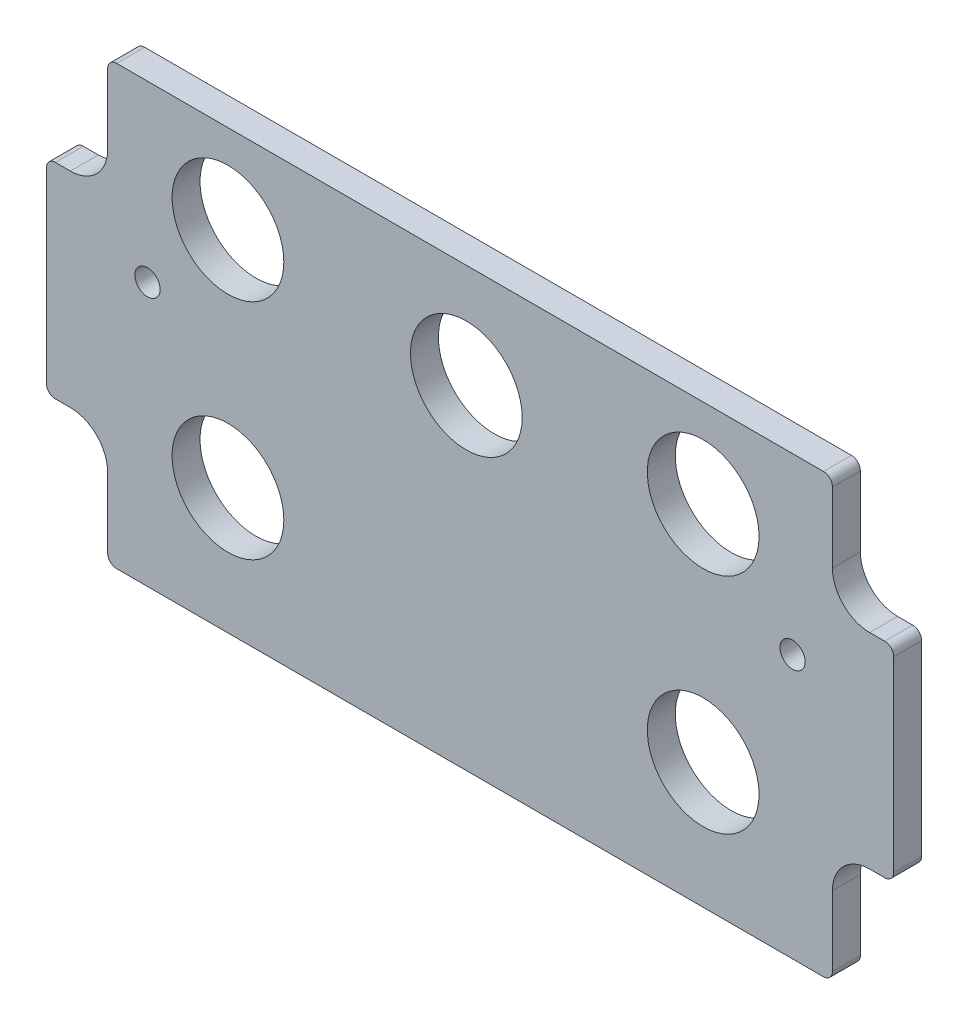
ISO-10303-21;
HEADER;
FILE_DESCRIPTION(('STEP AP214'),'2;1');
FILE_NAME('part.step','',(''),(''),'','','');
FILE_SCHEMA(('AUTOMOTIVE_DESIGN { 1 0 10303 214 1 1 1 1 }'));
ENDSEC;
DATA;
#1=APPLICATION_CONTEXT('core data for automotive mechanical design processes');
#2=APPLICATION_PROTOCOL_DEFINITION('international standard','automotive_design',2000,#1);
#3=PRODUCT_CONTEXT('',#1,'mechanical');
#4=PRODUCT('Part','Part','',(#3));
#5=PRODUCT_RELATED_PRODUCT_CATEGORY('part','',(#4));
#6=PRODUCT_DEFINITION_FORMATION('','',#4);
#7=PRODUCT_DEFINITION_CONTEXT('part definition',#1,'design');
#8=PRODUCT_DEFINITION('design','',#6,#7);
#9=PRODUCT_DEFINITION_SHAPE('','',#8);
#10=(LENGTH_UNIT() NAMED_UNIT(*) SI_UNIT(.MILLI.,.METRE.));
#11=(NAMED_UNIT(*) PLANE_ANGLE_UNIT() SI_UNIT($,.RADIAN.));
#12=(NAMED_UNIT(*) SI_UNIT($,.STERADIAN.) SOLID_ANGLE_UNIT());
#13=UNCERTAINTY_MEASURE_WITH_UNIT(LENGTH_MEASURE(1.E-05),#10,'distance_accuracy_value','');
#14=(GEOMETRIC_REPRESENTATION_CONTEXT(3) GLOBAL_UNCERTAINTY_ASSIGNED_CONTEXT((#13)) GLOBAL_UNIT_ASSIGNED_CONTEXT((#10,
#11,#12)) REPRESENTATION_CONTEXT('',''));
#15=CARTESIAN_POINT('',(0.,0.,0.));
#16=DIRECTION('',(0.,0.,1.));
#17=DIRECTION('',(1.,0.,0.));
#18=AXIS2_PLACEMENT_3D('',#15,#16,#17);
#19=CARTESIAN_POINT('',(141.1605,61.9125,4.7625));
#20=DIRECTION('',(0.,0.,-1.));
#21=DIRECTION('',(-1.,0.,0.));
#22=AXIS2_PLACEMENT_3D('',#19,#20,#21);
#23=CYLINDRICAL_SURFACE('',#22,6.34999999999994);
#24=CARTESIAN_POINT('',(141.1605,61.9125,0.));
#25=DIRECTION('',(0.,0.,-1.));
#26=DIRECTION('',(1.,0.,0.));
#27=AXIS2_PLACEMENT_3D('',#24,#25,#26);
#28=CIRCLE('',#27,6.34999999999994);
#29=CARTESIAN_POINT('',(141.160500000001,55.5625000000001,0.));
#30=VERTEX_POINT('',#29);
#31=CARTESIAN_POINT('',(134.8105,61.9125,0.));
#32=VERTEX_POINT('',#31);
#33=EDGE_CURVE('E230',#30,#32,#28,.T.);
#34=ORIENTED_EDGE('',*,*,#33,.T.);
#35=DIRECTION('',(0.,0.,-1.));
#36=VECTOR('',#35,1.);
#37=CARTESIAN_POINT('',(134.8105,61.9125,4.7625));
#38=LINE('',#37,#36);
#39=CARTESIAN_POINT('',(134.8105,61.9125,4.7625));
#40=VERTEX_POINT('',#39);
#41=EDGE_CURVE('E11',#40,#32,#38,.T.);
#42=ORIENTED_EDGE('',*,*,#41,.F.);
#43=CARTESIAN_POINT('',(141.1605,61.9125,4.7625));
#44=DIRECTION('',(0.,0.,-1.));
#45=DIRECTION('',(1.,0.,0.));
#46=AXIS2_PLACEMENT_3D('',#43,#44,#45);
#47=CIRCLE('',#46,6.34999999999994);
#48=CARTESIAN_POINT('',(141.160500000001,55.5625000000001,4.7625));
#49=VERTEX_POINT('',#48);
#50=EDGE_CURVE('E277',#49,#40,#47,.T.);
#51=ORIENTED_EDGE('',*,*,#50,.F.);
#52=DIRECTION('',(0.,0.,-1.));
#53=VECTOR('',#52,1.);
#54=CARTESIAN_POINT('',(141.160500000001,55.5625000000001,4.7625));
#55=LINE('',#54,#53);
#56=EDGE_CURVE('E226',#49,#30,#55,.T.);
#57=ORIENTED_EDGE('',*,*,#56,.T.);
#58=EDGE_LOOP('',(#34,#42,#51,#57));
#59=FACE_BOUND('',#58,.T.);
#60=ADVANCED_FACE('F38',(#59),#23,.F.);
#61=CARTESIAN_POINT('',(134.8105,61.9125,4.7625));
#62=DIRECTION('',(-1.,0.,0.));
#63=DIRECTION('',(0.,-1.,0.));
#64=AXIS2_PLACEMENT_3D('',#61,#62,#63);
#65=PLANE('',#64);
#66=DIRECTION('',(0.,1.,0.));
#67=VECTOR('',#66,1.);
#68=CARTESIAN_POINT('',(134.8105,61.9125,0.));
#69=LINE('',#68,#67);
#70=CARTESIAN_POINT('',(134.8105,73.88225,0.));
#71=VERTEX_POINT('',#70);
#72=EDGE_CURVE('E233',#32,#71,#69,.T.);
#73=ORIENTED_EDGE('',*,*,#72,.T.);
#74=DIRECTION('',(0.,0.,-1.));
#75=VECTOR('',#74,1.);
#76=CARTESIAN_POINT('',(134.8105,73.88225,4.7625));
#77=LINE('',#76,#75);
#78=CARTESIAN_POINT('',(134.8105,73.88225,4.7625));
#79=VERTEX_POINT('',#78);
#80=EDGE_CURVE('E46',#79,#71,#77,.T.);
#81=ORIENTED_EDGE('',*,*,#80,.F.);
#82=DIRECTION('',(0.,1.,0.));
#83=VECTOR('',#82,1.);
#84=CARTESIAN_POINT('',(134.8105,61.9125,4.7625));
#85=LINE('',#84,#83);
#86=EDGE_CURVE('E145',#40,#79,#85,.T.);
#87=ORIENTED_EDGE('',*,*,#86,.F.);
#88=ORIENTED_EDGE('',*,*,#41,.T.);
#89=EDGE_LOOP('',(#73,#81,#87,#88));
#90=FACE_BOUND('',#89,.T.);
#91=ADVANCED_FACE('F416',(#90),#65,.F.);
#92=CARTESIAN_POINT('',(133.2865,73.88225,4.7625));
#93=DIRECTION('',(0.,0.,-1.));
#94=DIRECTION('',(-1.,0.,0.));
#95=AXIS2_PLACEMENT_3D('',#92,#93,#94);
#96=CYLINDRICAL_SURFACE('',#95,1.52400000000003);
#97=CARTESIAN_POINT('',(133.2865,73.88225,0.));
#98=DIRECTION('',(0.,0.,1.));
#99=DIRECTION('',(1.,0.,0.));
#100=AXIS2_PLACEMENT_3D('',#97,#98,#99);
#101=CIRCLE('',#100,1.52400000000003);
#102=CARTESIAN_POINT('',(133.2865,75.40625,0.));
#103=VERTEX_POINT('',#102);
#104=EDGE_CURVE('E236',#71,#103,#101,.T.);
#105=ORIENTED_EDGE('',*,*,#104,.T.);
#106=DIRECTION('',(0.,0.,-1.));
#107=VECTOR('',#106,1.);
#108=CARTESIAN_POINT('',(133.2865,75.40625,4.7625));
#109=LINE('',#108,#107);
#110=CARTESIAN_POINT('',(133.2865,75.40625,4.7625));
#111=VERTEX_POINT('',#110);
#112=EDGE_CURVE('E332',#111,#103,#109,.T.);
#113=ORIENTED_EDGE('',*,*,#112,.F.);
#114=CARTESIAN_POINT('',(133.2865,73.88225,4.7625));
#115=DIRECTION('',(0.,0.,1.));
#116=DIRECTION('',(1.,0.,0.));
#117=AXIS2_PLACEMENT_3D('',#114,#115,#116);
#118=CIRCLE('',#117,1.52400000000003);
#119=EDGE_CURVE('E340',#79,#111,#118,.T.);
#120=ORIENTED_EDGE('',*,*,#119,.F.);
#121=ORIENTED_EDGE('',*,*,#80,.T.);
#122=EDGE_LOOP('',(#105,#113,#120,#121));
#123=FACE_BOUND('',#122,.T.);
#124=ADVANCED_FACE('F338',(#123),#96,.T.);
#125=CARTESIAN_POINT('',(133.2865,75.40625,4.7625));
#126=DIRECTION('',(0.,-1.,0.));
#127=DIRECTION('',(0.,0.,-1.));
#128=AXIS2_PLACEMENT_3D('',#125,#126,#127);
#129=PLANE('',#128);
#130=DIRECTION('',(-1.,0.,0.));
#131=VECTOR('',#130,1.);
#132=CARTESIAN_POINT('',(133.2865,75.40625,0.));
#133=LINE('',#132,#131);
#134=CARTESIAN_POINT('',(12.7635000000002,75.40625,0.));
#135=VERTEX_POINT('',#134);
#136=EDGE_CURVE('E238',#103,#135,#133,.T.);
#137=ORIENTED_EDGE('',*,*,#136,.T.);
#138=DIRECTION('',(0.,0.,-1.));
#139=VECTOR('',#138,1.);
#140=CARTESIAN_POINT('',(12.7635000000002,75.40625,4.7625));
#141=LINE('',#140,#139);
#142=CARTESIAN_POINT('',(12.7635000000002,75.40625,4.7625));
#143=VERTEX_POINT('',#142);
#144=EDGE_CURVE('E329',#143,#135,#141,.T.);
#145=ORIENTED_EDGE('',*,*,#144,.F.);
#146=DIRECTION('',(-1.,0.,0.));
#147=VECTOR('',#146,1.);
#148=CARTESIAN_POINT('',(133.2865,75.40625,4.7625));
#149=LINE('',#148,#147);
#150=EDGE_CURVE('E358',#111,#143,#149,.T.);
#151=ORIENTED_EDGE('',*,*,#150,.F.);
#152=ORIENTED_EDGE('',*,*,#112,.T.);
#153=EDGE_LOOP('',(#137,#145,#151,#152));
#154=FACE_BOUND('',#153,.T.);
#155=ADVANCED_FACE('F349',(#154),#129,.F.);
#156=CARTESIAN_POINT('',(12.7635000000002,73.88225,4.7625));
#157=DIRECTION('',(0.,0.,-1.));
#158=DIRECTION('',(-1.,0.,0.));
#159=AXIS2_PLACEMENT_3D('',#156,#157,#158);
#160=CYLINDRICAL_SURFACE('',#159,1.524);
#161=CARTESIAN_POINT('',(12.7635000000002,73.88225,0.));
#162=DIRECTION('',(0.,0.,1.));
#163=DIRECTION('',(1.,0.,0.));
#164=AXIS2_PLACEMENT_3D('',#161,#162,#163);
#165=CIRCLE('',#164,1.524);
#166=CARTESIAN_POINT('',(11.2395000000002,73.88225,0.));
#167=VERTEX_POINT('',#166);
#168=EDGE_CURVE('E240',#135,#167,#165,.T.);
#169=ORIENTED_EDGE('',*,*,#168,.T.);
#170=DIRECTION('',(0.,0.,-1.));
#171=VECTOR('',#170,1.);
#172=CARTESIAN_POINT('',(11.2395000000002,73.88225,4.7625));
#173=LINE('',#172,#171);
#174=CARTESIAN_POINT('',(11.2395000000002,73.88225,4.7625));
#175=VERTEX_POINT('',#174);
#176=EDGE_CURVE('E326',#175,#167,#173,.T.);
#177=ORIENTED_EDGE('',*,*,#176,.F.);
#178=CARTESIAN_POINT('',(12.7635000000002,73.88225,4.7625));
#179=DIRECTION('',(0.,0.,1.));
#180=DIRECTION('',(1.,0.,0.));
#181=AXIS2_PLACEMENT_3D('',#178,#179,#180);
#182=CIRCLE('',#181,1.524);
#183=EDGE_CURVE('E355',#143,#175,#182,.T.);
#184=ORIENTED_EDGE('',*,*,#183,.F.);
#185=ORIENTED_EDGE('',*,*,#144,.T.);
#186=EDGE_LOOP('',(#169,#177,#184,#185));
#187=FACE_BOUND('',#186,.T.);
#188=ADVANCED_FACE('F353',(#187),#160,.T.);
#189=CARTESIAN_POINT('',(11.2395000000002,73.88225,4.7625));
#190=DIRECTION('',(1.,0.,0.));
#191=DIRECTION('',(0.,1.,0.));
#192=AXIS2_PLACEMENT_3D('',#189,#190,#191);
#193=PLANE('',#192);
#194=DIRECTION('',(0.,-1.,0.));
#195=VECTOR('',#194,1.);
#196=CARTESIAN_POINT('',(11.2395000000002,73.88225,0.));
#197=LINE('',#196,#195);
#198=CARTESIAN_POINT('',(11.2395000000003,61.9125,0.));
#199=VERTEX_POINT('',#198);
#200=EDGE_CURVE('E242',#167,#199,#197,.T.);
#201=ORIENTED_EDGE('',*,*,#200,.T.);
#202=DIRECTION('',(0.,0.,-1.));
#203=VECTOR('',#202,1.);
#204=CARTESIAN_POINT('',(11.2395000000003,61.9125,4.7625));
#205=LINE('',#204,#203);
#206=CARTESIAN_POINT('',(11.2395000000003,61.9125,4.7625));
#207=VERTEX_POINT('',#206);
#208=EDGE_CURVE('E323',#207,#199,#205,.T.);
#209=ORIENTED_EDGE('',*,*,#208,.F.);
#210=DIRECTION('',(0.,-1.,0.));
#211=VECTOR('',#210,1.);
#212=CARTESIAN_POINT('',(11.2395000000002,73.88225,4.7625));
#213=LINE('',#212,#211);
#214=EDGE_CURVE('E357',#175,#207,#213,.T.);
#215=ORIENTED_EDGE('',*,*,#214,.F.);
#216=ORIENTED_EDGE('',*,*,#176,.T.);
#217=EDGE_LOOP('',(#201,#209,#215,#216));
#218=FACE_BOUND('',#217,.T.);
#219=ADVANCED_FACE('F429',(#218),#193,.F.);
#220=CARTESIAN_POINT('',(4.88950000000036,61.9125,4.7625));
#221=DIRECTION('',(0.,0.,-1.));
#222=DIRECTION('',(-1.,0.,0.));
#223=AXIS2_PLACEMENT_3D('',#220,#221,#222);
#224=CYLINDRICAL_SURFACE('',#223,6.34999999999997);
#225=CARTESIAN_POINT('',(4.88950000000036,61.9125,0.));
#226=DIRECTION('',(0.,0.,-1.));
#227=DIRECTION('',(1.,0.,0.));
#228=AXIS2_PLACEMENT_3D('',#225,#226,#227);
#229=CIRCLE('',#228,6.34999999999997);
#230=CARTESIAN_POINT('',(4.88950000000014,55.5625,0.));
#231=VERTEX_POINT('',#230);
#232=EDGE_CURVE('E244',#199,#231,#229,.T.);
#233=ORIENTED_EDGE('',*,*,#232,.T.);
#234=DIRECTION('',(0.,0.,-1.));
#235=VECTOR('',#234,1.);
#236=CARTESIAN_POINT('',(4.88950000000014,55.5625,4.7625));
#237=LINE('',#236,#235);
#238=CARTESIAN_POINT('',(4.88950000000014,55.5625,4.7625));
#239=VERTEX_POINT('',#238);
#240=EDGE_CURVE('E320',#239,#231,#237,.T.);
#241=ORIENTED_EDGE('',*,*,#240,.F.);
#242=CARTESIAN_POINT('',(4.88950000000036,61.9125,4.7625));
#243=DIRECTION('',(0.,0.,-1.));
#244=DIRECTION('',(1.,0.,0.));
#245=AXIS2_PLACEMENT_3D('',#242,#243,#244);
#246=CIRCLE('',#245,6.34999999999997);
#247=EDGE_CURVE('E360',#207,#239,#246,.T.);
#248=ORIENTED_EDGE('',*,*,#247,.F.);
#249=ORIENTED_EDGE('',*,*,#208,.T.);
#250=EDGE_LOOP('',(#233,#241,#248,#249));
#251=FACE_BOUND('',#250,.T.);
#252=ADVANCED_FACE('F432',(#251),#224,.F.);
#253=CARTESIAN_POINT('',(4.88950000000014,55.5625,4.7625));
#254=DIRECTION('',(0.,-1.,0.));
#255=DIRECTION('',(1.,0.,0.));
#256=AXIS2_PLACEMENT_3D('',#253,#254,#255);
#257=PLANE('',#256);
#258=DIRECTION('',(-1.,0.,0.));
#259=VECTOR('',#258,1.);
#260=CARTESIAN_POINT('',(4.88950000000014,55.5625,0.));
#261=LINE('',#260,#259);
#262=CARTESIAN_POINT('',(2.31775000000038,55.5625000000002,0.));
#263=VERTEX_POINT('',#262);
#264=EDGE_CURVE('E246',#231,#263,#261,.T.);
#265=ORIENTED_EDGE('',*,*,#264,.T.);
#266=DIRECTION('',(0.,0.,-1.));
#267=VECTOR('',#266,1.);
#268=CARTESIAN_POINT('',(2.31775000000038,55.5625000000002,4.7625));
#269=LINE('',#268,#267);
#270=CARTESIAN_POINT('',(2.31775000000038,55.5625000000002,4.7625));
#271=VERTEX_POINT('',#270);
#272=EDGE_CURVE('E317',#271,#263,#269,.T.);
#273=ORIENTED_EDGE('',*,*,#272,.F.);
#274=DIRECTION('',(-1.,0.,0.));
#275=VECTOR('',#274,1.);
#276=CARTESIAN_POINT('',(4.88950000000014,55.5625,4.7625));
#277=LINE('',#276,#275);
#278=EDGE_CURVE('E366',#239,#271,#277,.T.);
#279=ORIENTED_EDGE('',*,*,#278,.F.);
#280=ORIENTED_EDGE('',*,*,#240,.T.);
#281=EDGE_LOOP('',(#265,#273,#279,#280));
#282=FACE_BOUND('',#281,.T.);
#283=ADVANCED_FACE('F436',(#282),#257,.F.);
#284=CARTESIAN_POINT('',(2.31775000000033,54.0385000000003,4.7625));
#285=DIRECTION('',(0.,0.,-1.));
#286=DIRECTION('',(-1.,0.,0.));
#287=AXIS2_PLACEMENT_3D('',#284,#285,#286);
#288=CYLINDRICAL_SURFACE('',#287,1.52399999999997);
#289=CARTESIAN_POINT('',(2.31775000000033,54.0385000000003,0.));
#290=DIRECTION('',(0.,0.,1.));
#291=DIRECTION('',(1.,0.,0.));
#292=AXIS2_PLACEMENT_3D('',#289,#290,#291);
#293=CIRCLE('',#292,1.52399999999997);
#294=CARTESIAN_POINT('',(0.793750000000361,54.0385000000003,0.));
#295=VERTEX_POINT('',#294);
#296=EDGE_CURVE('E248',#263,#295,#293,.T.);
#297=ORIENTED_EDGE('',*,*,#296,.T.);
#298=DIRECTION('',(0.,0.,-1.));
#299=VECTOR('',#298,1.);
#300=CARTESIAN_POINT('',(0.793750000000361,54.0385000000003,4.7625));
#301=LINE('',#300,#299);
#302=CARTESIAN_POINT('',(0.793750000000361,54.0385000000003,4.7625));
#303=VERTEX_POINT('',#302);
#304=EDGE_CURVE('E314',#303,#295,#301,.T.);
#305=ORIENTED_EDGE('',*,*,#304,.F.);
#306=CARTESIAN_POINT('',(2.31775000000033,54.0385000000003,4.7625));
#307=DIRECTION('',(0.,0.,1.));
#308=DIRECTION('',(1.,0.,0.));
#309=AXIS2_PLACEMENT_3D('',#306,#307,#308);
#310=CIRCLE('',#309,1.52399999999997);
#311=EDGE_CURVE('E368',#271,#303,#310,.T.);
#312=ORIENTED_EDGE('',*,*,#311,.F.);
#313=ORIENTED_EDGE('',*,*,#272,.T.);
#314=EDGE_LOOP('',(#297,#305,#312,#313));
#315=FACE_BOUND('',#314,.T.);
#316=ADVANCED_FACE('F440',(#315),#288,.T.);
#317=CARTESIAN_POINT('',(0.793750000000328,54.0385000000003,4.7625));
#318=DIRECTION('',(1.,0.,0.));
#319=DIRECTION('',(0.,1.,0.));
#320=AXIS2_PLACEMENT_3D('',#317,#318,#319);
#321=PLANE('',#320);
#322=DIRECTION('',(0.,-1.,0.));
#323=VECTOR('',#322,1.);
#324=CARTESIAN_POINT('',(0.793750000000328,54.0385000000003,0.));
#325=LINE('',#324,#323);
#326=CARTESIAN_POINT('',(0.793750000000338,22.1614999999998,0.));
#327=VERTEX_POINT('',#326);
#328=EDGE_CURVE('E250',#295,#327,#325,.T.);
#329=ORIENTED_EDGE('',*,*,#328,.T.);
#330=DIRECTION('',(0.,0.,-1.));
#331=VECTOR('',#330,1.);
#332=CARTESIAN_POINT('',(0.793750000000338,22.1614999999998,4.7625));
#333=LINE('',#332,#331);
#334=CARTESIAN_POINT('',(0.793750000000338,22.1614999999998,4.7625));
#335=VERTEX_POINT('',#334);
#336=EDGE_CURVE('E311',#335,#327,#333,.T.);
#337=ORIENTED_EDGE('',*,*,#336,.F.);
#338=DIRECTION('',(0.,-1.,0.));
#339=VECTOR('',#338,1.);
#340=CARTESIAN_POINT('',(0.793750000000328,54.0385000000003,4.7625));
#341=LINE('',#340,#339);
#342=EDGE_CURVE('E370',#303,#335,#341,.T.);
#343=ORIENTED_EDGE('',*,*,#342,.F.);
#344=ORIENTED_EDGE('',*,*,#304,.T.);
#345=EDGE_LOOP('',(#329,#337,#343,#344));
#346=FACE_BOUND('',#345,.T.);
#347=ADVANCED_FACE('F444',(#346),#321,.F.);
#348=CARTESIAN_POINT('',(2.31775000000033,22.1614999999998,4.7625));
#349=DIRECTION('',(0.,0.,-1.));
#350=DIRECTION('',(-1.,0.,0.));
#351=AXIS2_PLACEMENT_3D('',#348,#349,#350);
#352=CYLINDRICAL_SURFACE('',#351,1.52399999999999);
#353=CARTESIAN_POINT('',(2.31775000000033,22.1614999999998,0.));
#354=DIRECTION('',(0.,0.,1.));
#355=DIRECTION('',(1.,0.,0.));
#356=AXIS2_PLACEMENT_3D('',#353,#354,#355);
#357=CIRCLE('',#356,1.52399999999999);
#358=CARTESIAN_POINT('',(2.31775000000038,20.6374999999999,0.));
#359=VERTEX_POINT('',#358);
#360=EDGE_CURVE('E252',#327,#359,#357,.T.);
#361=ORIENTED_EDGE('',*,*,#360,.T.);
#362=DIRECTION('',(0.,0.,-1.));
#363=VECTOR('',#362,1.);
#364=CARTESIAN_POINT('',(2.31775000000038,20.6374999999999,4.7625));
#365=LINE('',#364,#363);
#366=CARTESIAN_POINT('',(2.31775000000038,20.6374999999999,4.7625));
#367=VERTEX_POINT('',#366);
#368=EDGE_CURVE('E308',#367,#359,#365,.T.);
#369=ORIENTED_EDGE('',*,*,#368,.F.);
#370=CARTESIAN_POINT('',(2.31775000000033,22.1614999999998,4.7625));
#371=DIRECTION('',(0.,0.,1.));
#372=DIRECTION('',(1.,0.,0.));
#373=AXIS2_PLACEMENT_3D('',#370,#371,#372);
#374=CIRCLE('',#373,1.52399999999999);
#375=EDGE_CURVE('E372',#335,#367,#374,.T.);
#376=ORIENTED_EDGE('',*,*,#375,.F.);
#377=ORIENTED_EDGE('',*,*,#336,.T.);
#378=EDGE_LOOP('',(#361,#369,#376,#377));
#379=FACE_BOUND('',#378,.T.);
#380=ADVANCED_FACE('F448',(#379),#352,.T.);
#381=CARTESIAN_POINT('',(2.31775000000038,20.6374999999999,4.7625));
#382=DIRECTION('',(0.,1.,0.));
#383=DIRECTION('',(-1.,0.,0.));
#384=AXIS2_PLACEMENT_3D('',#381,#382,#383);
#385=PLANE('',#384);
#386=DIRECTION('',(1.,0.,0.));
#387=VECTOR('',#386,1.);
#388=CARTESIAN_POINT('',(2.31775000000038,20.6374999999999,0.));
#389=LINE('',#388,#387);
#390=CARTESIAN_POINT('',(4.88950000000014,20.6375,0.));
#391=VERTEX_POINT('',#390);
#392=EDGE_CURVE('E254',#359,#391,#389,.T.);
#393=ORIENTED_EDGE('',*,*,#392,.T.);
#394=DIRECTION('',(0.,0.,-1.));
#395=VECTOR('',#394,1.);
#396=CARTESIAN_POINT('',(4.88950000000014,20.6375,4.7625));
#397=LINE('',#396,#395);
#398=CARTESIAN_POINT('',(4.88950000000014,20.6375,4.7625));
#399=VERTEX_POINT('',#398);
#400=EDGE_CURVE('E305',#399,#391,#397,.T.);
#401=ORIENTED_EDGE('',*,*,#400,.F.);
#402=DIRECTION('',(1.,0.,0.));
#403=VECTOR('',#402,1.);
#404=CARTESIAN_POINT('',(2.31775000000038,20.6374999999999,4.7625));
#405=LINE('',#404,#403);
#406=EDGE_CURVE('E374',#367,#399,#405,.T.);
#407=ORIENTED_EDGE('',*,*,#406,.F.);
#408=ORIENTED_EDGE('',*,*,#368,.T.);
#409=EDGE_LOOP('',(#393,#401,#407,#408));
#410=FACE_BOUND('',#409,.T.);
#411=ADVANCED_FACE('F452',(#410),#385,.F.);
#412=CARTESIAN_POINT('',(4.88950000000036,14.2875,4.7625));
#413=DIRECTION('',(0.,0.,-1.));
#414=DIRECTION('',(-1.,0.,0.));
#415=AXIS2_PLACEMENT_3D('',#412,#413,#414);
#416=CYLINDRICAL_SURFACE('',#415,6.34999999999998);
#417=CARTESIAN_POINT('',(4.88950000000036,14.2875,0.));
#418=DIRECTION('',(0.,0.,-1.));
#419=DIRECTION('',(1.,0.,0.));
#420=AXIS2_PLACEMENT_3D('',#417,#418,#419);
#421=CIRCLE('',#420,6.34999999999998);
#422=CARTESIAN_POINT('',(11.2395000000003,14.2875,0.));
#423=VERTEX_POINT('',#422);
#424=EDGE_CURVE('E256',#391,#423,#421,.T.);
#425=ORIENTED_EDGE('',*,*,#424,.T.);
#426=DIRECTION('',(0.,0.,-1.));
#427=VECTOR('',#426,1.);
#428=CARTESIAN_POINT('',(11.2395000000003,14.2875,4.7625));
#429=LINE('',#428,#427);
#430=CARTESIAN_POINT('',(11.2395000000003,14.2875,4.7625));
#431=VERTEX_POINT('',#430);
#432=EDGE_CURVE('E302',#431,#423,#429,.T.);
#433=ORIENTED_EDGE('',*,*,#432,.F.);
#434=CARTESIAN_POINT('',(4.88950000000036,14.2875,4.7625));
#435=DIRECTION('',(0.,0.,-1.));
#436=DIRECTION('',(1.,0.,0.));
#437=AXIS2_PLACEMENT_3D('',#434,#435,#436);
#438=CIRCLE('',#437,6.34999999999998);
#439=EDGE_CURVE('E376',#399,#431,#438,.T.);
#440=ORIENTED_EDGE('',*,*,#439,.F.);
#441=ORIENTED_EDGE('',*,*,#400,.T.);
#442=EDGE_LOOP('',(#425,#433,#440,#441));
#443=FACE_BOUND('',#442,.T.);
#444=ADVANCED_FACE('F456',(#443),#416,.F.);
#445=CARTESIAN_POINT('',(11.2395000000004,14.2875,4.7625));
#446=DIRECTION('',(1.,0.,0.));
#447=DIRECTION('',(0.,1.,0.));
#448=AXIS2_PLACEMENT_3D('',#445,#446,#447);
#449=PLANE('',#448);
#450=DIRECTION('',(0.,-1.,0.));
#451=VECTOR('',#450,1.);
#452=CARTESIAN_POINT('',(11.2395000000004,14.2875,0.));
#453=LINE('',#452,#451);
#454=CARTESIAN_POINT('',(11.2395000000002,2.31775000000006,0.));
#455=VERTEX_POINT('',#454);
#456=EDGE_CURVE('E258',#423,#455,#453,.T.);
#457=ORIENTED_EDGE('',*,*,#456,.T.);
#458=DIRECTION('',(0.,0.,-1.));
#459=VECTOR('',#458,1.);
#460=CARTESIAN_POINT('',(11.2395000000002,2.31775000000006,4.7625));
#461=LINE('',#460,#459);
#462=CARTESIAN_POINT('',(11.2395000000002,2.31775000000006,4.7625));
#463=VERTEX_POINT('',#462);
#464=EDGE_CURVE('E299',#463,#455,#461,.T.);
#465=ORIENTED_EDGE('',*,*,#464,.F.);
#466=DIRECTION('',(0.,-1.,0.));
#467=VECTOR('',#466,1.);
#468=CARTESIAN_POINT('',(11.2395000000004,14.2875,4.7625));
#469=LINE('',#468,#467);
#470=EDGE_CURVE('E378',#431,#463,#469,.T.);
#471=ORIENTED_EDGE('',*,*,#470,.F.);
#472=ORIENTED_EDGE('',*,*,#432,.T.);
#473=EDGE_LOOP('',(#457,#465,#471,#472));
#474=FACE_BOUND('',#473,.T.);
#475=ADVANCED_FACE('F460',(#474),#449,.F.);
#476=CARTESIAN_POINT('',(12.7635000000002,2.31775000000005,4.7625));
#477=DIRECTION('',(0.,0.,-1.));
#478=DIRECTION('',(-1.,0.,0.));
#479=AXIS2_PLACEMENT_3D('',#476,#477,#478);
#480=CYLINDRICAL_SURFACE('',#479,1.52399999999998);
#481=CARTESIAN_POINT('',(12.7635000000002,2.31775000000005,0.));
#482=DIRECTION('',(0.,0.,1.));
#483=DIRECTION('',(1.,0.,0.));
#484=AXIS2_PLACEMENT_3D('',#481,#482,#483);
#485=CIRCLE('',#484,1.52399999999998);
#486=CARTESIAN_POINT('',(12.7635000000002,0.793750000000068,0.));
#487=VERTEX_POINT('',#486);
#488=EDGE_CURVE('E260',#455,#487,#485,.T.);
#489=ORIENTED_EDGE('',*,*,#488,.T.);
#490=DIRECTION('',(0.,0.,-1.));
#491=VECTOR('',#490,1.);
#492=CARTESIAN_POINT('',(12.7635000000002,0.793750000000068,4.7625));
#493=LINE('',#492,#491);
#494=CARTESIAN_POINT('',(12.7635000000002,0.793750000000068,4.7625));
#495=VERTEX_POINT('',#494);
#496=EDGE_CURVE('E296',#495,#487,#493,.T.);
#497=ORIENTED_EDGE('',*,*,#496,.F.);
#498=CARTESIAN_POINT('',(12.7635000000002,2.31775000000005,4.7625));
#499=DIRECTION('',(0.,0.,1.));
#500=DIRECTION('',(1.,0.,0.));
#501=AXIS2_PLACEMENT_3D('',#498,#499,#500);
#502=CIRCLE('',#501,1.52399999999998);
#503=EDGE_CURVE('E380',#463,#495,#502,.T.);
#504=ORIENTED_EDGE('',*,*,#503,.F.);
#505=ORIENTED_EDGE('',*,*,#464,.T.);
#506=EDGE_LOOP('',(#489,#497,#504,#505));
#507=FACE_BOUND('',#506,.T.);
#508=ADVANCED_FACE('F464',(#507),#480,.T.);
#509=CARTESIAN_POINT('',(12.7635000000002,0.793750000000044,4.7625));
#510=DIRECTION('',(0.,1.,0.));
#511=DIRECTION('',(-1.,0.,0.));
#512=AXIS2_PLACEMENT_3D('',#509,#510,#511);
#513=PLANE('',#512);
#514=DIRECTION('',(1.,0.,0.));
#515=VECTOR('',#514,1.);
#516=CARTESIAN_POINT('',(12.7635000000002,0.793750000000044,0.));
#517=LINE('',#516,#515);
#518=CARTESIAN_POINT('',(133.286500000001,0.79374999999998,0.));
#519=VERTEX_POINT('',#518);
#520=EDGE_CURVE('E262',#487,#519,#517,.T.);
#521=ORIENTED_EDGE('',*,*,#520,.T.);
#522=DIRECTION('',(0.,0.,-1.));
#523=VECTOR('',#522,1.);
#524=CARTESIAN_POINT('',(133.286500000001,0.79374999999998,4.7625));
#525=LINE('',#524,#523);
#526=CARTESIAN_POINT('',(133.286500000001,0.79374999999998,4.7625));
#527=VERTEX_POINT('',#526);
#528=EDGE_CURVE('E293',#527,#519,#525,.T.);
#529=ORIENTED_EDGE('',*,*,#528,.F.);
#530=DIRECTION('',(1.,0.,0.));
#531=VECTOR('',#530,1.);
#532=CARTESIAN_POINT('',(12.7635000000002,0.793750000000044,4.7625));
#533=LINE('',#532,#531);
#534=EDGE_CURVE('E382',#495,#527,#533,.T.);
#535=ORIENTED_EDGE('',*,*,#534,.F.);
#536=ORIENTED_EDGE('',*,*,#496,.T.);
#537=EDGE_LOOP('',(#521,#529,#535,#536));
#538=FACE_BOUND('',#537,.T.);
#539=ADVANCED_FACE('F468',(#538),#513,.F.);
#540=CARTESIAN_POINT('',(133.286500000001,2.31774999999994,4.7625));
#541=DIRECTION('',(0.,0.,-1.));
#542=DIRECTION('',(-1.,0.,0.));
#543=AXIS2_PLACEMENT_3D('',#540,#541,#542);
#544=CYLINDRICAL_SURFACE('',#543,1.52399999999996);
#545=CARTESIAN_POINT('',(133.286500000001,2.31774999999994,0.));
#546=DIRECTION('',(0.,0.,1.));
#547=DIRECTION('',(1.,0.,0.));
#548=AXIS2_PLACEMENT_3D('',#545,#546,#547);
#549=CIRCLE('',#548,1.52399999999996);
#550=CARTESIAN_POINT('',(134.810500000001,2.31774999999995,0.));
#551=VERTEX_POINT('',#550);
#552=EDGE_CURVE('E264',#519,#551,#549,.T.);
#553=ORIENTED_EDGE('',*,*,#552,.T.);
#554=DIRECTION('',(0.,0.,-1.));
#555=VECTOR('',#554,1.);
#556=CARTESIAN_POINT('',(134.810500000001,2.31774999999995,4.7625));
#557=LINE('',#556,#555);
#558=CARTESIAN_POINT('',(134.810500000001,2.31774999999995,4.7625));
#559=VERTEX_POINT('',#558);
#560=EDGE_CURVE('E290',#559,#551,#557,.T.);
#561=ORIENTED_EDGE('',*,*,#560,.F.);
#562=CARTESIAN_POINT('',(133.286500000001,2.31774999999994,4.7625));
#563=DIRECTION('',(0.,0.,1.));
#564=DIRECTION('',(1.,0.,0.));
#565=AXIS2_PLACEMENT_3D('',#562,#563,#564);
#566=CIRCLE('',#565,1.52399999999996);
#567=EDGE_CURVE('E384',#527,#559,#566,.T.);
#568=ORIENTED_EDGE('',*,*,#567,.F.);
#569=ORIENTED_EDGE('',*,*,#528,.T.);
#570=EDGE_LOOP('',(#553,#561,#568,#569));
#571=FACE_BOUND('',#570,.T.);
#572=ADVANCED_FACE('F472',(#571),#544,.T.);
#573=CARTESIAN_POINT('',(134.810500000001,2.31774999999995,4.7625));
#574=DIRECTION('',(-1.,0.,0.));
#575=DIRECTION('',(0.,-1.,0.));
#576=AXIS2_PLACEMENT_3D('',#573,#574,#575);
#577=PLANE('',#576);
#578=DIRECTION('',(0.,1.,0.));
#579=VECTOR('',#578,1.);
#580=CARTESIAN_POINT('',(134.810500000001,2.31774999999995,0.));
#581=LINE('',#580,#579);
#582=CARTESIAN_POINT('',(134.8105,14.2875,0.));
#583=VERTEX_POINT('',#582);
#584=EDGE_CURVE('E266',#551,#583,#581,.T.);
#585=ORIENTED_EDGE('',*,*,#584,.T.);
#586=DIRECTION('',(0.,0.,-1.));
#587=VECTOR('',#586,1.);
#588=CARTESIAN_POINT('',(134.8105,14.2875,4.7625));
#589=LINE('',#588,#587);
#590=CARTESIAN_POINT('',(134.8105,14.2875,4.7625));
#591=VERTEX_POINT('',#590);
#592=EDGE_CURVE('E287',#591,#583,#589,.T.);
#593=ORIENTED_EDGE('',*,*,#592,.F.);
#594=DIRECTION('',(0.,1.,0.));
#595=VECTOR('',#594,1.);
#596=CARTESIAN_POINT('',(134.810500000001,2.31774999999995,4.7625));
#597=LINE('',#596,#595);
#598=EDGE_CURVE('E386',#559,#591,#597,.T.);
#599=ORIENTED_EDGE('',*,*,#598,.F.);
#600=ORIENTED_EDGE('',*,*,#560,.T.);
#601=EDGE_LOOP('',(#585,#593,#599,#600));
#602=FACE_BOUND('',#601,.T.);
#603=ADVANCED_FACE('F476',(#602),#577,.F.);
#604=CARTESIAN_POINT('',(141.1605,14.2875,4.7625));
#605=DIRECTION('',(0.,0.,-1.));
#606=DIRECTION('',(-1.,0.,0.));
#607=AXIS2_PLACEMENT_3D('',#604,#605,#606);
#608=CYLINDRICAL_SURFACE('',#607,6.34999999999997);
#609=CARTESIAN_POINT('',(141.1605,14.2875,0.));
#610=DIRECTION('',(0.,0.,-1.));
#611=DIRECTION('',(1.,0.,0.));
#612=AXIS2_PLACEMENT_3D('',#609,#610,#611);
#613=CIRCLE('',#612,6.34999999999997);
#614=CARTESIAN_POINT('',(141.160500000001,20.6375,0.));
#615=VERTEX_POINT('',#614);
#616=EDGE_CURVE('E268',#583,#615,#613,.T.);
#617=ORIENTED_EDGE('',*,*,#616,.T.);
#618=DIRECTION('',(0.,0.,-1.));
#619=VECTOR('',#618,1.);
#620=CARTESIAN_POINT('',(141.160500000001,20.6375,4.7625));
#621=LINE('',#620,#619);
#622=CARTESIAN_POINT('',(141.160500000001,20.6375,4.7625));
#623=VERTEX_POINT('',#622);
#624=EDGE_CURVE('E284',#623,#615,#621,.T.);
#625=ORIENTED_EDGE('',*,*,#624,.F.);
#626=CARTESIAN_POINT('',(141.1605,14.2875,4.7625));
#627=DIRECTION('',(0.,0.,-1.));
#628=DIRECTION('',(1.,0.,0.));
#629=AXIS2_PLACEMENT_3D('',#626,#627,#628);
#630=CIRCLE('',#629,6.34999999999997);
#631=EDGE_CURVE('E388',#591,#623,#630,.T.);
#632=ORIENTED_EDGE('',*,*,#631,.F.);
#633=ORIENTED_EDGE('',*,*,#592,.T.);
#634=EDGE_LOOP('',(#617,#625,#632,#633));
#635=FACE_BOUND('',#634,.T.);
#636=ADVANCED_FACE('F480',(#635),#608,.F.);
#637=CARTESIAN_POINT('',(141.160500000001,20.6375,4.7625));
#638=DIRECTION('',(0.,1.,0.));
#639=DIRECTION('',(-1.,0.,0.));
#640=AXIS2_PLACEMENT_3D('',#637,#638,#639);
#641=PLANE('',#640);
#642=DIRECTION('',(1.,0.,0.));
#643=VECTOR('',#642,1.);
#644=CARTESIAN_POINT('',(141.160500000001,20.6375,0.));
#645=LINE('',#644,#643);
#646=CARTESIAN_POINT('',(143.73225,20.6374999999999,0.));
#647=VERTEX_POINT('',#646);
#648=EDGE_CURVE('E270',#615,#647,#645,.T.);
#649=ORIENTED_EDGE('',*,*,#648,.T.);
#650=DIRECTION('',(0.,0.,-1.));
#651=VECTOR('',#650,1.);
#652=CARTESIAN_POINT('',(143.73225,20.6374999999999,4.7625));
#653=LINE('',#652,#651);
#654=CARTESIAN_POINT('',(143.73225,20.6374999999999,4.7625));
#655=VERTEX_POINT('',#654);
#656=EDGE_CURVE('E281',#655,#647,#653,.T.);
#657=ORIENTED_EDGE('',*,*,#656,.F.);
#658=DIRECTION('',(1.,0.,0.));
#659=VECTOR('',#658,1.);
#660=CARTESIAN_POINT('',(141.160500000001,20.6375,4.7625));
#661=LINE('',#660,#659);
#662=EDGE_CURVE('E390',#623,#655,#661,.T.);
#663=ORIENTED_EDGE('',*,*,#662,.F.);
#664=ORIENTED_EDGE('',*,*,#624,.T.);
#665=EDGE_LOOP('',(#649,#657,#663,#664));
#666=FACE_BOUND('',#665,.T.);
#667=ADVANCED_FACE('F396',(#666),#641,.F.);
#668=CARTESIAN_POINT('',(143.73225,22.1614999999998,4.7625));
#669=DIRECTION('',(0.,0.,-1.));
#670=DIRECTION('',(-1.,0.,0.));
#671=AXIS2_PLACEMENT_3D('',#668,#669,#670);
#672=CYLINDRICAL_SURFACE('',#671,1.52399999999997);
#673=CARTESIAN_POINT('',(143.73225,22.1614999999998,0.));
#674=DIRECTION('',(0.,0.,1.));
#675=DIRECTION('',(1.,0.,0.));
#676=AXIS2_PLACEMENT_3D('',#673,#674,#675);
#677=CIRCLE('',#676,1.52399999999997);
#678=CARTESIAN_POINT('',(145.25625,22.1614999999998,0.));
#679=VERTEX_POINT('',#678);
#680=EDGE_CURVE('E272',#647,#679,#677,.T.);
#681=ORIENTED_EDGE('',*,*,#680,.T.);
#682=DIRECTION('',(0.,0.,-1.));
#683=VECTOR('',#682,1.);
#684=CARTESIAN_POINT('',(145.25625,22.1614999999998,4.7625));
#685=LINE('',#684,#683);
#686=CARTESIAN_POINT('',(145.25625,22.1614999999998,4.7625));
#687=VERTEX_POINT('',#686);
#688=EDGE_CURVE('E221',#687,#679,#685,.T.);
#689=ORIENTED_EDGE('',*,*,#688,.F.);
#690=CARTESIAN_POINT('',(143.73225,22.1614999999998,4.7625));
#691=DIRECTION('',(0.,0.,1.));
#692=DIRECTION('',(1.,0.,0.));
#693=AXIS2_PLACEMENT_3D('',#690,#691,#692);
#694=CIRCLE('',#693,1.52399999999997);
#695=EDGE_CURVE('E212',#655,#687,#694,.T.);
#696=ORIENTED_EDGE('',*,*,#695,.F.);
#697=ORIENTED_EDGE('',*,*,#656,.T.);
#698=EDGE_LOOP('',(#681,#689,#696,#697));
#699=FACE_BOUND('',#698,.T.);
#700=ADVANCED_FACE('F400',(#699),#672,.T.);
#701=CARTESIAN_POINT('',(145.25625,22.1614999999998,4.7625));
#702=DIRECTION('',(-1.,0.,0.));
#703=DIRECTION('',(0.,-1.,0.));
#704=AXIS2_PLACEMENT_3D('',#701,#702,#703);
#705=PLANE('',#704);
#706=DIRECTION('',(0.,1.,0.));
#707=VECTOR('',#706,1.);
#708=CARTESIAN_POINT('',(145.25625,22.1614999999998,0.));
#709=LINE('',#708,#707);
#710=CARTESIAN_POINT('',(145.25625,54.0385000000003,0.));
#711=VERTEX_POINT('',#710);
#712=EDGE_CURVE('E220',#679,#711,#709,.T.);
#713=ORIENTED_EDGE('',*,*,#712,.T.);
#714=DIRECTION('',(0.,0.,-1.));
#715=VECTOR('',#714,1.);
#716=CARTESIAN_POINT('',(145.25625,54.0385000000003,4.7625));
#717=LINE('',#716,#715);
#718=CARTESIAN_POINT('',(145.25625,54.0385000000003,4.7625));
#719=VERTEX_POINT('',#718);
#720=EDGE_CURVE('E217',#719,#711,#717,.T.);
#721=ORIENTED_EDGE('',*,*,#720,.F.);
#722=DIRECTION('',(0.,1.,0.));
#723=VECTOR('',#722,1.);
#724=CARTESIAN_POINT('',(145.25625,22.1614999999998,4.7625));
#725=LINE('',#724,#723);
#726=EDGE_CURVE('E206',#687,#719,#725,.T.);
#727=ORIENTED_EDGE('',*,*,#726,.F.);
#728=ORIENTED_EDGE('',*,*,#688,.T.);
#729=EDGE_LOOP('',(#713,#721,#727,#728));
#730=FACE_BOUND('',#729,.T.);
#731=ADVANCED_FACE('F218',(#730),#705,.F.);
#732=CARTESIAN_POINT('',(143.73225,54.0385000000003,4.7625));
#733=DIRECTION('',(0.,0.,-1.));
#734=DIRECTION('',(-1.,0.,0.));
#735=AXIS2_PLACEMENT_3D('',#732,#733,#734);
#736=CYLINDRICAL_SURFACE('',#735,1.52399999999996);
#737=CARTESIAN_POINT('',(143.73225,54.0385000000003,0.));
#738=DIRECTION('',(0.,0.,1.));
#739=DIRECTION('',(1.,0.,0.));
#740=AXIS2_PLACEMENT_3D('',#737,#738,#739);
#741=CIRCLE('',#740,1.52399999999996);
#742=CARTESIAN_POINT('',(143.73225,55.5625000000002,0.));
#743=VERTEX_POINT('',#742);
#744=EDGE_CURVE('E131',#711,#743,#741,.T.);
#745=ORIENTED_EDGE('',*,*,#744,.T.);
#746=DIRECTION('',(0.,0.,-1.));
#747=VECTOR('',#746,1.);
#748=CARTESIAN_POINT('',(143.73225,55.5625000000002,4.7625));
#749=LINE('',#748,#747);
#750=CARTESIAN_POINT('',(143.73225,55.5625000000002,4.7625));
#751=VERTEX_POINT('',#750);
#752=EDGE_CURVE('E222',#751,#743,#749,.T.);
#753=ORIENTED_EDGE('',*,*,#752,.F.);
#754=CARTESIAN_POINT('',(143.73225,54.0385000000003,4.7625));
#755=DIRECTION('',(0.,0.,1.));
#756=DIRECTION('',(1.,0.,0.));
#757=AXIS2_PLACEMENT_3D('',#754,#755,#756);
#758=CIRCLE('',#757,1.52399999999996);
#759=EDGE_CURVE('E210',#719,#751,#758,.T.);
#760=ORIENTED_EDGE('',*,*,#759,.F.);
#761=ORIENTED_EDGE('',*,*,#720,.T.);
#762=EDGE_LOOP('',(#745,#753,#760,#761));
#763=FACE_BOUND('',#762,.T.);
#764=ADVANCED_FACE('F224',(#763),#736,.T.);
#765=CARTESIAN_POINT('',(143.73225,55.5625000000002,4.7625));
#766=DIRECTION('',(0.,-1.,0.));
#767=DIRECTION('',(1.,0.,0.));
#768=AXIS2_PLACEMENT_3D('',#765,#766,#767);
#769=PLANE('',#768);
#770=DIRECTION('',(-1.,0.,0.));
#771=VECTOR('',#770,1.);
#772=CARTESIAN_POINT('',(143.73225,55.5625000000002,0.));
#773=LINE('',#772,#771);
#774=EDGE_CURVE('E137',#743,#30,#773,.T.);
#775=ORIENTED_EDGE('',*,*,#774,.T.);
#776=ORIENTED_EDGE('',*,*,#56,.F.);
#777=DIRECTION('',(-1.,0.,0.));
#778=VECTOR('',#777,1.);
#779=CARTESIAN_POINT('',(143.73225,55.5625000000002,4.7625));
#780=LINE('',#779,#778);
#781=EDGE_CURVE('E54',#751,#49,#780,.T.);
#782=ORIENTED_EDGE('',*,*,#781,.F.);
#783=ORIENTED_EDGE('',*,*,#752,.T.);
#784=EDGE_LOOP('',(#775,#776,#782,#783));
#785=FACE_BOUND('',#784,.T.);
#786=ADVANCED_FACE('F404',(#785),#769,.F.);
#787=CARTESIAN_POINT('',(141.1605,61.9125,4.7625));
#788=DIRECTION('',(0.,0.,1.));
#789=DIRECTION('',(1.,0.,0.));
#790=AXIS2_PLACEMENT_3D('',#787,#788,#789);
#791=PLANE('',#790);
#792=CARTESIAN_POINT('',(18.0340000000003,45.72,4.7625));
#793=DIRECTION('',(0.,0.,1.));
#794=DIRECTION('',(1.,0.,0.));
#795=AXIS2_PLACEMENT_3D('',#792,#793,#794);
#796=CIRCLE('',#795,2.15265);
#797=CARTESIAN_POINT('',(20.1866500000003,45.72,4.7625));
#798=VERTEX_POINT('',#797);
#799=EDGE_CURVE('E574',#798,#798,#796,.T.);
#800=ORIENTED_EDGE('',*,*,#799,.F.);
#801=EDGE_LOOP('',(#800));
#802=FACE_BOUND('',#801,.T.);
#803=CARTESIAN_POINT('',(128.016,45.72,4.7625));
#804=DIRECTION('',(0.,0.,1.));
#805=DIRECTION('',(1.,0.,0.));
#806=AXIS2_PLACEMENT_3D('',#803,#804,#805);
#807=CIRCLE('',#806,2.15265000000001);
#808=CARTESIAN_POINT('',(130.16865,45.72,4.7625));
#809=VERTEX_POINT('',#808);
#810=EDGE_CURVE('E576',#809,#809,#807,.T.);
#811=ORIENTED_EDGE('',*,*,#810,.F.);
#812=EDGE_LOOP('',(#811));
#813=FACE_BOUND('',#812,.T.);
#814=CARTESIAN_POINT('',(31.7500000000003,60.325,4.7625));
#815=DIRECTION('',(0.,0.,1.));
#816=DIRECTION('',(1.,0.,0.));
#817=AXIS2_PLACEMENT_3D('',#814,#815,#816);
#818=CIRCLE('',#817,9.525);
#819=CARTESIAN_POINT('',(41.2750000000003,60.325,4.7625));
#820=VERTEX_POINT('',#819);
#821=EDGE_CURVE('E584',#820,#820,#818,.T.);
#822=ORIENTED_EDGE('',*,*,#821,.F.);
#823=EDGE_LOOP('',(#822));
#824=FACE_BOUND('',#823,.T.);
#825=CARTESIAN_POINT('',(72.3900000000003,57.658,4.7625));
#826=DIRECTION('',(0.,0.,1.));
#827=DIRECTION('',(1.,0.,0.));
#828=AXIS2_PLACEMENT_3D('',#825,#826,#827);
#829=CIRCLE('',#828,9.52499999999999);
#830=CARTESIAN_POINT('',(81.9150000000003,57.658,4.7625));
#831=VERTEX_POINT('',#830);
#832=EDGE_CURVE('E590',#831,#831,#829,.T.);
#833=ORIENTED_EDGE('',*,*,#832,.F.);
#834=EDGE_LOOP('',(#833));
#835=FACE_BOUND('',#834,.T.);
#836=CARTESIAN_POINT('',(112.776,60.325,4.7625));
#837=DIRECTION('',(0.,0.,1.));
#838=DIRECTION('',(1.,0.,0.));
#839=AXIS2_PLACEMENT_3D('',#836,#837,#838);
#840=CIRCLE('',#839,9.52499999999999);
#841=CARTESIAN_POINT('',(122.301,60.325,4.7625));
#842=VERTEX_POINT('',#841);
#843=EDGE_CURVE('E596',#842,#842,#840,.T.);
#844=ORIENTED_EDGE('',*,*,#843,.F.);
#845=EDGE_LOOP('',(#844));
#846=FACE_BOUND('',#845,.T.);
#847=CARTESIAN_POINT('',(112.776,22.225,4.7625));
#848=DIRECTION('',(0.,0.,1.));
#849=DIRECTION('',(1.,0.,0.));
#850=AXIS2_PLACEMENT_3D('',#847,#848,#849);
#851=CIRCLE('',#850,9.52499999999999);
#852=CARTESIAN_POINT('',(122.301,22.225,4.7625));
#853=VERTEX_POINT('',#852);
#854=EDGE_CURVE('E602',#853,#853,#851,.T.);
#855=ORIENTED_EDGE('',*,*,#854,.F.);
#856=EDGE_LOOP('',(#855));
#857=FACE_BOUND('',#856,.T.);
#858=CARTESIAN_POINT('',(31.7500000000003,22.225,4.7625));
#859=DIRECTION('',(0.,0.,1.));
#860=DIRECTION('',(1.,0.,0.));
#861=AXIS2_PLACEMENT_3D('',#858,#859,#860);
#862=CIRCLE('',#861,9.525);
#863=CARTESIAN_POINT('',(41.2750000000003,22.225,4.7625));
#864=VERTEX_POINT('',#863);
#865=EDGE_CURVE('E608',#864,#864,#862,.T.);
#866=ORIENTED_EDGE('',*,*,#865,.F.);
#867=EDGE_LOOP('',(#866));
#868=FACE_BOUND('',#867,.T.);
#869=ORIENTED_EDGE('',*,*,#50,.T.);
#870=ORIENTED_EDGE('',*,*,#86,.T.);
#871=ORIENTED_EDGE('',*,*,#119,.T.);
#872=ORIENTED_EDGE('',*,*,#150,.T.);
#873=ORIENTED_EDGE('',*,*,#183,.T.);
#874=ORIENTED_EDGE('',*,*,#214,.T.);
#875=ORIENTED_EDGE('',*,*,#247,.T.);
#876=ORIENTED_EDGE('',*,*,#278,.T.);
#877=ORIENTED_EDGE('',*,*,#311,.T.);
#878=ORIENTED_EDGE('',*,*,#342,.T.);
#879=ORIENTED_EDGE('',*,*,#375,.T.);
#880=ORIENTED_EDGE('',*,*,#406,.T.);
#881=ORIENTED_EDGE('',*,*,#439,.T.);
#882=ORIENTED_EDGE('',*,*,#470,.T.);
#883=ORIENTED_EDGE('',*,*,#503,.T.);
#884=ORIENTED_EDGE('',*,*,#534,.T.);
#885=ORIENTED_EDGE('',*,*,#567,.T.);
#886=ORIENTED_EDGE('',*,*,#598,.T.);
#887=ORIENTED_EDGE('',*,*,#631,.T.);
#888=ORIENTED_EDGE('',*,*,#662,.T.);
#889=ORIENTED_EDGE('',*,*,#695,.T.);
#890=ORIENTED_EDGE('',*,*,#726,.T.);
#891=ORIENTED_EDGE('',*,*,#759,.T.);
#892=ORIENTED_EDGE('',*,*,#781,.T.);
#893=EDGE_LOOP('',(#869,#870,#871,#872,#873,#874,#875,#876,#877,#878,#879,#880,#881,#882,#883,
#884,#885,#886,#887,#888,#889,#890,#891,#892));
#894=FACE_BOUND('',#893,.T.);
#895=ADVANCED_FACE('F208',(#802,#813,#824,#835,#846,#857,#868,#894),#791,.T.);
#896=CARTESIAN_POINT('',(141.1605,61.9125,0.));
#897=DIRECTION('',(0.,0.,1.));
#898=DIRECTION('',(1.,0.,0.));
#899=AXIS2_PLACEMENT_3D('',#896,#897,#898);
#900=PLANE('',#899);
#901=CARTESIAN_POINT('',(18.0340000000003,45.72,0.));
#902=DIRECTION('',(0.,0.,1.));
#903=DIRECTION('',(1.,0.,0.));
#904=AXIS2_PLACEMENT_3D('',#901,#902,#903);
#905=CIRCLE('',#904,2.15265);
#906=CARTESIAN_POINT('',(20.1866500000003,45.72,0.));
#907=VERTEX_POINT('',#906);
#908=EDGE_CURVE('E571',#907,#907,#905,.T.);
#909=ORIENTED_EDGE('',*,*,#908,.T.);
#910=EDGE_LOOP('',(#909));
#911=FACE_BOUND('',#910,.T.);
#912=CARTESIAN_POINT('',(128.016,45.72,0.));
#913=DIRECTION('',(0.,0.,1.));
#914=DIRECTION('',(1.,0.,0.));
#915=AXIS2_PLACEMENT_3D('',#912,#913,#914);
#916=CIRCLE('',#915,2.15265000000001);
#917=CARTESIAN_POINT('',(130.16865,45.72,0.));
#918=VERTEX_POINT('',#917);
#919=EDGE_CURVE('E581',#918,#918,#916,.T.);
#920=ORIENTED_EDGE('',*,*,#919,.T.);
#921=EDGE_LOOP('',(#920));
#922=FACE_BOUND('',#921,.T.);
#923=CARTESIAN_POINT('',(31.7500000000003,60.325,0.));
#924=DIRECTION('',(0.,0.,1.));
#925=DIRECTION('',(1.,0.,0.));
#926=AXIS2_PLACEMENT_3D('',#923,#924,#925);
#927=CIRCLE('',#926,9.525);
#928=CARTESIAN_POINT('',(41.2750000000003,60.325,0.));
#929=VERTEX_POINT('',#928);
#930=EDGE_CURVE('E587',#929,#929,#927,.T.);
#931=ORIENTED_EDGE('',*,*,#930,.T.);
#932=EDGE_LOOP('',(#931));
#933=FACE_BOUND('',#932,.T.);
#934=CARTESIAN_POINT('',(72.3900000000003,57.658,0.));
#935=DIRECTION('',(0.,0.,1.));
#936=DIRECTION('',(1.,0.,0.));
#937=AXIS2_PLACEMENT_3D('',#934,#935,#936);
#938=CIRCLE('',#937,9.52499999999999);
#939=CARTESIAN_POINT('',(81.9150000000003,57.658,0.));
#940=VERTEX_POINT('',#939);
#941=EDGE_CURVE('E593',#940,#940,#938,.T.);
#942=ORIENTED_EDGE('',*,*,#941,.T.);
#943=EDGE_LOOP('',(#942));
#944=FACE_BOUND('',#943,.T.);
#945=CARTESIAN_POINT('',(112.776,60.325,0.));
#946=DIRECTION('',(0.,0.,1.));
#947=DIRECTION('',(1.,0.,0.));
#948=AXIS2_PLACEMENT_3D('',#945,#946,#947);
#949=CIRCLE('',#948,9.52499999999999);
#950=CARTESIAN_POINT('',(122.301,60.325,0.));
#951=VERTEX_POINT('',#950);
#952=EDGE_CURVE('E599',#951,#951,#949,.T.);
#953=ORIENTED_EDGE('',*,*,#952,.T.);
#954=EDGE_LOOP('',(#953));
#955=FACE_BOUND('',#954,.T.);
#956=CARTESIAN_POINT('',(112.776,22.225,0.));
#957=DIRECTION('',(0.,0.,1.));
#958=DIRECTION('',(1.,0.,0.));
#959=AXIS2_PLACEMENT_3D('',#956,#957,#958);
#960=CIRCLE('',#959,9.52499999999999);
#961=CARTESIAN_POINT('',(122.301,22.225,0.));
#962=VERTEX_POINT('',#961);
#963=EDGE_CURVE('E605',#962,#962,#960,.T.);
#964=ORIENTED_EDGE('',*,*,#963,.T.);
#965=EDGE_LOOP('',(#964));
#966=FACE_BOUND('',#965,.T.);
#967=CARTESIAN_POINT('',(31.7500000000003,22.225,0.));
#968=DIRECTION('',(0.,0.,1.));
#969=DIRECTION('',(1.,0.,0.));
#970=AXIS2_PLACEMENT_3D('',#967,#968,#969);
#971=CIRCLE('',#970,9.525);
#972=CARTESIAN_POINT('',(41.2750000000003,22.225,0.));
#973=VERTEX_POINT('',#972);
#974=EDGE_CURVE('E234',#973,#973,#971,.T.);
#975=ORIENTED_EDGE('',*,*,#974,.T.);
#976=EDGE_LOOP('',(#975));
#977=FACE_BOUND('',#976,.T.);
#978=ORIENTED_EDGE('',*,*,#33,.F.);
#979=ORIENTED_EDGE('',*,*,#774,.F.);
#980=ORIENTED_EDGE('',*,*,#744,.F.);
#981=ORIENTED_EDGE('',*,*,#712,.F.);
#982=ORIENTED_EDGE('',*,*,#680,.F.);
#983=ORIENTED_EDGE('',*,*,#648,.F.);
#984=ORIENTED_EDGE('',*,*,#616,.F.);
#985=ORIENTED_EDGE('',*,*,#584,.F.);
#986=ORIENTED_EDGE('',*,*,#552,.F.);
#987=ORIENTED_EDGE('',*,*,#520,.F.);
#988=ORIENTED_EDGE('',*,*,#488,.F.);
#989=ORIENTED_EDGE('',*,*,#456,.F.);
#990=ORIENTED_EDGE('',*,*,#424,.F.);
#991=ORIENTED_EDGE('',*,*,#392,.F.);
#992=ORIENTED_EDGE('',*,*,#360,.F.);
#993=ORIENTED_EDGE('',*,*,#328,.F.);
#994=ORIENTED_EDGE('',*,*,#296,.F.);
#995=ORIENTED_EDGE('',*,*,#264,.F.);
#996=ORIENTED_EDGE('',*,*,#232,.F.);
#997=ORIENTED_EDGE('',*,*,#200,.F.);
#998=ORIENTED_EDGE('',*,*,#168,.F.);
#999=ORIENTED_EDGE('',*,*,#136,.F.);
#1000=ORIENTED_EDGE('',*,*,#104,.F.);
#1001=ORIENTED_EDGE('',*,*,#72,.F.);
#1002=EDGE_LOOP('',(#978,#979,#980,#981,#982,#983,#984,#985,#986,#987,#988,#989,#990,#991,#992,
#993,#994,#995,#996,#997,#998,#999,#1000,#1001));
#1003=FACE_BOUND('',#1002,.T.);
#1004=ADVANCED_FACE('F344',(#911,#922,#933,#944,#955,#966,#977,#1003),#900,.F.);
#1005=CARTESIAN_POINT('',(31.7500000000003,22.225,4.7625));
#1006=DIRECTION('',(0.,0.,1.));
#1007=DIRECTION('',(1.,0.,0.));
#1008=AXIS2_PLACEMENT_3D('',#1005,#1006,#1007);
#1009=CYLINDRICAL_SURFACE('',#1008,9.525);
#1010=ORIENTED_EDGE('',*,*,#974,.F.);
#1011=EDGE_LOOP('',(#1010));
#1012=FACE_BOUND('',#1011,.T.);
#1013=ORIENTED_EDGE('',*,*,#865,.T.);
#1014=EDGE_LOOP('',(#1013));
#1015=FACE_BOUND('',#1014,.T.);
#1016=ADVANCED_FACE('F511',(#1012,#1015),#1009,.F.);
#1017=CARTESIAN_POINT('',(112.776,22.225,4.7625));
#1018=DIRECTION('',(0.,0.,1.));
#1019=DIRECTION('',(1.,0.,0.));
#1020=AXIS2_PLACEMENT_3D('',#1017,#1018,#1019);
#1021=CYLINDRICAL_SURFACE('',#1020,9.52499999999999);
#1022=ORIENTED_EDGE('',*,*,#963,.F.);
#1023=EDGE_LOOP('',(#1022));
#1024=FACE_BOUND('',#1023,.T.);
#1025=ORIENTED_EDGE('',*,*,#854,.T.);
#1026=EDGE_LOOP('',(#1025));
#1027=FACE_BOUND('',#1026,.T.);
#1028=ADVANCED_FACE('F518',(#1024,#1027),#1021,.F.);
#1029=CARTESIAN_POINT('',(112.776,60.325,4.7625));
#1030=DIRECTION('',(0.,0.,1.));
#1031=DIRECTION('',(1.,0.,0.));
#1032=AXIS2_PLACEMENT_3D('',#1029,#1030,#1031);
#1033=CYLINDRICAL_SURFACE('',#1032,9.52499999999999);
#1034=ORIENTED_EDGE('',*,*,#952,.F.);
#1035=EDGE_LOOP('',(#1034));
#1036=FACE_BOUND('',#1035,.T.);
#1037=ORIENTED_EDGE('',*,*,#843,.T.);
#1038=EDGE_LOOP('',(#1037));
#1039=FACE_BOUND('',#1038,.T.);
#1040=ADVANCED_FACE('F526',(#1036,#1039),#1033,.F.);
#1041=CARTESIAN_POINT('',(72.3900000000003,57.658,4.7625));
#1042=DIRECTION('',(0.,0.,1.));
#1043=DIRECTION('',(1.,0.,0.));
#1044=AXIS2_PLACEMENT_3D('',#1041,#1042,#1043);
#1045=CYLINDRICAL_SURFACE('',#1044,9.52499999999999);
#1046=ORIENTED_EDGE('',*,*,#941,.F.);
#1047=EDGE_LOOP('',(#1046));
#1048=FACE_BOUND('',#1047,.T.);
#1049=ORIENTED_EDGE('',*,*,#832,.T.);
#1050=EDGE_LOOP('',(#1049));
#1051=FACE_BOUND('',#1050,.T.);
#1052=ADVANCED_FACE('F534',(#1048,#1051),#1045,.F.);
#1053=CARTESIAN_POINT('',(31.7500000000003,60.325,4.7625));
#1054=DIRECTION('',(0.,0.,1.));
#1055=DIRECTION('',(1.,0.,0.));
#1056=AXIS2_PLACEMENT_3D('',#1053,#1054,#1055);
#1057=CYLINDRICAL_SURFACE('',#1056,9.525);
#1058=ORIENTED_EDGE('',*,*,#930,.F.);
#1059=EDGE_LOOP('',(#1058));
#1060=FACE_BOUND('',#1059,.T.);
#1061=ORIENTED_EDGE('',*,*,#821,.T.);
#1062=EDGE_LOOP('',(#1061));
#1063=FACE_BOUND('',#1062,.T.);
#1064=ADVANCED_FACE('F542',(#1060,#1063),#1057,.F.);
#1065=CARTESIAN_POINT('',(128.016,45.72,4.7625));
#1066=DIRECTION('',(0.,0.,1.));
#1067=DIRECTION('',(1.,0.,0.));
#1068=AXIS2_PLACEMENT_3D('',#1065,#1066,#1067);
#1069=CYLINDRICAL_SURFACE('',#1068,2.15265000000001);
#1070=ORIENTED_EDGE('',*,*,#919,.F.);
#1071=EDGE_LOOP('',(#1070));
#1072=FACE_BOUND('',#1071,.T.);
#1073=ORIENTED_EDGE('',*,*,#810,.T.);
#1074=EDGE_LOOP('',(#1073));
#1075=FACE_BOUND('',#1074,.T.);
#1076=ADVANCED_FACE('F550',(#1072,#1075),#1069,.F.);
#1077=CARTESIAN_POINT('',(18.0340000000003,45.72,4.7625));
#1078=DIRECTION('',(0.,0.,1.));
#1079=DIRECTION('',(1.,0.,0.));
#1080=AXIS2_PLACEMENT_3D('',#1077,#1078,#1079);
#1081=CYLINDRICAL_SURFACE('',#1080,2.15265);
#1082=ORIENTED_EDGE('',*,*,#908,.F.);
#1083=EDGE_LOOP('',(#1082));
#1084=FACE_BOUND('',#1083,.T.);
#1085=ORIENTED_EDGE('',*,*,#799,.T.);
#1086=EDGE_LOOP('',(#1085));
#1087=FACE_BOUND('',#1086,.T.);
#1088=ADVANCED_FACE('F558',(#1084,#1087),#1081,.F.);
#1089=CLOSED_SHELL('',(#60,#91,#124,#155,#188,#219,#252,#283,#316,#347,#380,#411,#444,#475,#508,
#539,#572,#603,#636,#667,#700,#731,#764,#786,#895,#1004,#1016,#1028,#1040,#1052,#1064,#1076,#1088));
#1090=MANIFOLD_SOLID_BREP('B2',#1089);
#1091=ADVANCED_BREP_SHAPE_REPRESENTATION('',(#18,#1090),#14);
#1092=SHAPE_DEFINITION_REPRESENTATION(#9,#1091);
ENDSEC;
END-ISO-10303-21;
